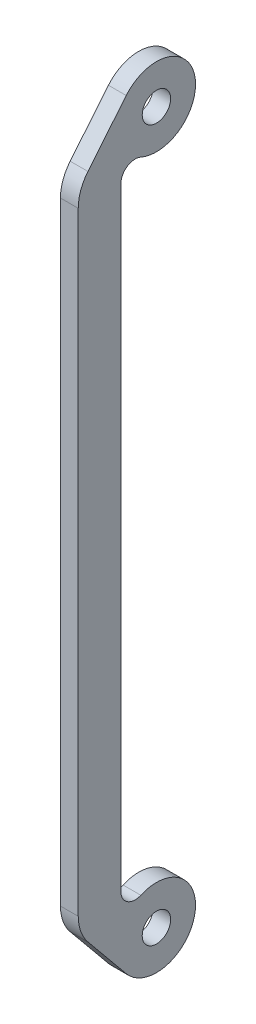
ISO-10303-21;
HEADER;
FILE_DESCRIPTION(('STEP AP214'),'2;1');
FILE_NAME('part.step','',(''),(''),'','','');
FILE_SCHEMA(('AUTOMOTIVE_DESIGN { 1 0 10303 214 1 1 1 1 }'));
ENDSEC;
DATA;
#1=APPLICATION_CONTEXT('core data for automotive mechanical design processes');
#2=APPLICATION_PROTOCOL_DEFINITION('international standard','automotive_design',2000,#1);
#3=PRODUCT_CONTEXT('',#1,'mechanical');
#4=PRODUCT('Part','Part','',(#3));
#5=PRODUCT_RELATED_PRODUCT_CATEGORY('part','',(#4));
#6=PRODUCT_DEFINITION_FORMATION('','',#4);
#7=PRODUCT_DEFINITION_CONTEXT('part definition',#1,'design');
#8=PRODUCT_DEFINITION('design','',#6,#7);
#9=PRODUCT_DEFINITION_SHAPE('','',#8);
#10=(LENGTH_UNIT() NAMED_UNIT(*) SI_UNIT(.MILLI.,.METRE.));
#11=(NAMED_UNIT(*) PLANE_ANGLE_UNIT() SI_UNIT($,.RADIAN.));
#12=(NAMED_UNIT(*) SI_UNIT($,.STERADIAN.) SOLID_ANGLE_UNIT());
#13=UNCERTAINTY_MEASURE_WITH_UNIT(LENGTH_MEASURE(1.E-05),#10,'distance_accuracy_value','');
#14=(GEOMETRIC_REPRESENTATION_CONTEXT(3) GLOBAL_UNCERTAINTY_ASSIGNED_CONTEXT((#13)) GLOBAL_UNIT_ASSIGNED_CONTEXT((#10,
#11,#12)) REPRESENTATION_CONTEXT('',''));
#15=CARTESIAN_POINT('',(0.,0.,0.));
#16=DIRECTION('',(0.,0.,1.));
#17=DIRECTION('',(1.,0.,0.));
#18=AXIS2_PLACEMENT_3D('',#15,#16,#17);
#19=CARTESIAN_POINT('',(97.4999999999046,88.7522729343273,5.99999995622887));
#20=DIRECTION('',(-1.,-1.10653153306827E-12,0.));
#21=DIRECTION('',(0.,-2.58294427513128E-12,1.));
#22=AXIS2_PLACEMENT_3D('',#19,#20,#21);
#23=PLANE('',#22);
#24=CARTESIAN_POINT('',(97.5000000001107,-97.4999999999899,-2.58167619227049E-10));
#25=DIRECTION('',(-1.,-1.10653153306827E-12,0.));
#26=DIRECTION('',(0.,-2.58294427513128E-12,1.));
#27=AXIS2_PLACEMENT_3D('',#24,#25,#26);
#28=CIRCLE('',#27,4.);
#29=CARTESIAN_POINT('',(97.5000000001107,-97.5000000000002,3.99999999974183));
#30=VERTEX_POINT('',#29);
#31=EDGE_CURVE('E162',#30,#30,#28,.T.);
#32=ORIENTED_EDGE('',*,*,#31,.F.);
#33=EDGE_LOOP('',(#32));
#34=FACE_BOUND('',#33,.T.);
#35=CARTESIAN_POINT('',(97.4999999999046,88.7522729343273,5.99999995622887));
#36=DIRECTION('',(1.,1.10653153306827E-12,0.));
#37=DIRECTION('',(0.,-2.58294427513128E-12,1.));
#38=AXIS2_PLACEMENT_3D('',#35,#36,#37);
#39=CIRCLE('',#38,4.00000000000016);
#40=CARTESIAN_POINT('',(97.4999999999006,92.4183334851762,4.39999994450656));
#41=VERTEX_POINT('',#40);
#42=CARTESIAN_POINT('',(97.4999999999046,88.7522729343169,9.99999995622887));
#43=VERTEX_POINT('',#42);
#44=EDGE_CURVE('E186',#41,#43,#39,.T.);
#45=ORIENTED_EDGE('',*,*,#44,.T.);
#46=DIRECTION('',(1.10653153306827E-12,-1.,-2.58294427513128E-12));
#47=VECTOR('',#46,1.);
#48=CARTESIAN_POINT('',(97.5000000000955,-83.7522728959471,9.9999999557833));
#49=LINE('',#48,#47);
#50=CARTESIAN_POINT('',(97.5000000000955,-83.7522728959471,9.99999995578347));
#51=VERTEX_POINT('',#50);
#52=EDGE_CURVE('E110',#43,#51,#49,.T.);
#53=ORIENTED_EDGE('',*,*,#52,.T.);
#54=CARTESIAN_POINT('',(97.5000000000955,-83.7522728959368,5.9999999557833));
#55=DIRECTION('',(1.,1.10653153306827E-12,0.));
#56=DIRECTION('',(0.,-2.58294427513128E-12,1.));
#57=AXIS2_PLACEMENT_3D('',#54,#55,#56);
#58=CIRCLE('',#57,4.00000000000017);
#59=CARTESIAN_POINT('',(97.5000000000995,-87.4183334570177,4.39999996750551));
#60=VERTEX_POINT('',#59);
#61=EDGE_CURVE('E215',#51,#60,#58,.T.);
#62=ORIENTED_EDGE('',*,*,#61,.T.);
#63=CARTESIAN_POINT('',(97.5000000001107,-97.4999999999899,-2.58167619227049E-10));
#64=DIRECTION('',(-1.,-1.10653153306827E-12,0.));
#65=DIRECTION('',(0.,-2.58294427513128E-12,1.));
#66=AXIS2_PLACEMENT_3D('',#63,#64,#65);
#67=CIRCLE('',#66,11.0000000000002);
#68=CARTESIAN_POINT('',(97.5000000001184,-104.482653611021,8.49956166775536));
#69=VERTEX_POINT('',#68);
#70=EDGE_CURVE('E235',#60,#69,#67,.T.);
#71=ORIENTED_EDGE('',*,*,#70,.T.);
#72=DIRECTION('',(-8.55003000266829E-13,0.772687424364855,0.634786691911863));
#73=VECTOR('',#72,1.);
#74=CARTESIAN_POINT('',(97.5000000001184,-104.482653611021,8.49956166775536));
#75=LINE('',#74,#73);
#76=CARTESIAN_POINT('',(97.5000000001039,-91.3697131988906,19.2722490481608));
#77=VERTEX_POINT('',#76);
#78=EDGE_CURVE('E231',#69,#77,#75,.T.);
#79=ORIENTED_EDGE('',*,*,#78,.T.);
#80=CARTESIAN_POINT('',(97.5000000000955,-83.7522728959471,9.9999999557833));
#81=DIRECTION('',(-1.,-1.10653153306827E-12,0.));
#82=DIRECTION('',(0.,-2.58294427513128E-12,1.));
#83=AXIS2_PLACEMENT_3D('',#80,#81,#82);
#84=CIRCLE('',#83,12.0000000000001);
#85=CARTESIAN_POINT('',(97.5000000000955,-83.7522724027184,21.9999999557833));
#86=VERTEX_POINT('',#85);
#87=EDGE_CURVE('E234',#77,#86,#84,.T.);
#88=ORIENTED_EDGE('',*,*,#87,.T.);
#89=DIRECTION('',(-1.10653153306827E-12,1.,2.58294427513128E-12));
#90=VECTOR('',#89,1.);
#91=CARTESIAN_POINT('',(97.5000000000955,-83.7522724027184,21.9999999557833));
#92=LINE('',#91,#90);
#93=CARTESIAN_POINT('',(97.4999999999046,88.7522734275466,21.999999956229));
#94=VERTEX_POINT('',#93);
#95=EDGE_CURVE('E135',#86,#94,#92,.T.);
#96=ORIENTED_EDGE('',*,*,#95,.T.);
#97=CARTESIAN_POINT('',(97.4999999999046,88.7522729343169,9.99999995622887));
#98=DIRECTION('',(-1.,-1.10653153306827E-12,0.));
#99=DIRECTION('',(0.,-2.58294427513128E-12,1.));
#100=AXIS2_PLACEMENT_3D('',#97,#98,#99);
#101=CIRCLE('',#100,12.0000000000001);
#102=CARTESIAN_POINT('',(97.4999999998962,96.3697132876767,19.272249007188));
#103=VERTEX_POINT('',#102);
#104=EDGE_CURVE('E129',#94,#103,#101,.T.);
#105=ORIENTED_EDGE('',*,*,#104,.T.);
#106=DIRECTION('',(-8.55002996443895E-13,0.772687420913254,-0.634786696113288));
#107=VECTOR('',#106,1.);
#108=CARTESIAN_POINT('',(97.4999999998962,96.3697132876767,19.272249007188));
#109=LINE('',#108,#107);
#110=CARTESIAN_POINT('',(97.4999999998817,109.482653657257,8.49956154231629));
#111=VERTEX_POINT('',#110);
#112=EDGE_CURVE('E133',#103,#111,#109,.T.);
#113=ORIENTED_EDGE('',*,*,#112,.T.);
#114=CARTESIAN_POINT('',(97.4999999998894,102.50000000001,-8.77295671663452E-08));
#115=DIRECTION('',(-1.,-1.10653153306827E-12,0.));
#116=DIRECTION('',(0.,-2.58294427513128E-12,1.));
#117=AXIS2_PLACEMENT_3D('',#114,#115,#116);
#118=CIRCLE('',#117,11.0000000000002);
#119=EDGE_CURVE('E61',#111,#41,#118,.T.);
#120=ORIENTED_EDGE('',*,*,#119,.T.);
#121=EDGE_LOOP('',(#45,#53,#62,#71,#79,#88,#96,#105,#113,#120));
#122=FACE_BOUND('',#121,.T.);
#123=CARTESIAN_POINT('',(97.4999999998894,102.50000000001,-8.77295671663452E-08));
#124=DIRECTION('',(-1.,-1.10653153306827E-12,0.));
#125=DIRECTION('',(0.,-2.58294427513128E-12,1.));
#126=AXIS2_PLACEMENT_3D('',#123,#124,#125);
#127=CIRCLE('',#126,4.00000000000002);
#128=CARTESIAN_POINT('',(97.4999999998894,102.5,3.99999991227046));
#129=VERTEX_POINT('',#128);
#130=EDGE_CURVE('E253',#129,#129,#127,.T.);
#131=ORIENTED_EDGE('',*,*,#130,.F.);
#132=EDGE_LOOP('',(#131));
#133=FACE_BOUND('',#132,.T.);
#134=ADVANCED_FACE('F43',(#34,#122,#133),#23,.T.);
#135=CARTESIAN_POINT('',(102.499999999905,88.7522729343328,5.99999995622887));
#136=DIRECTION('',(-1.,-1.10653153306827E-12,0.));
#137=DIRECTION('',(0.,-2.58294427513128E-12,1.));
#138=AXIS2_PLACEMENT_3D('',#135,#136,#137);
#139=PLANE('',#138);
#140=CARTESIAN_POINT('',(102.499999999905,88.7522729343328,5.99999995622887));
#141=DIRECTION('',(1.,1.10653153306827E-12,0.));
#142=DIRECTION('',(0.,-2.58294427513128E-12,1.));
#143=AXIS2_PLACEMENT_3D('',#140,#141,#142);
#144=CIRCLE('',#143,4.00000000000016);
#145=CARTESIAN_POINT('',(102.499999999901,92.4183334851817,4.39999994450656));
#146=VERTEX_POINT('',#145);
#147=CARTESIAN_POINT('',(102.499999999905,88.7522729343224,9.99999995622887));
#148=VERTEX_POINT('',#147);
#149=EDGE_CURVE('E157',#146,#148,#144,.T.);
#150=ORIENTED_EDGE('',*,*,#149,.F.);
#151=CARTESIAN_POINT('',(102.499999999889,102.500000000016,-8.77295671663452E-08));
#152=DIRECTION('',(-1.,-1.10653153306827E-12,0.));
#153=DIRECTION('',(0.,-2.58294427513128E-12,1.));
#154=AXIS2_PLACEMENT_3D('',#151,#152,#153);
#155=CIRCLE('',#154,11.0000000000002);
#156=CARTESIAN_POINT('',(102.499999999882,109.482653657262,8.49956154231629));
#157=VERTEX_POINT('',#156);
#158=EDGE_CURVE('E102',#157,#146,#155,.T.);
#159=ORIENTED_EDGE('',*,*,#158,.F.);
#160=DIRECTION('',(-8.55002996443895E-13,0.772687420913254,-0.634786696113288));
#161=VECTOR('',#160,1.);
#162=CARTESIAN_POINT('',(102.499999999896,96.3697132876822,19.272249007188));
#163=LINE('',#162,#161);
#164=CARTESIAN_POINT('',(102.499999999896,96.3697132876822,19.272249007188));
#165=VERTEX_POINT('',#164);
#166=EDGE_CURVE('E96',#165,#157,#163,.T.);
#167=ORIENTED_EDGE('',*,*,#166,.F.);
#168=CARTESIAN_POINT('',(102.499999999905,88.7522729343224,9.99999995622887));
#169=DIRECTION('',(-1.,-1.10653153306827E-12,0.));
#170=DIRECTION('',(0.,-2.58294427513128E-12,1.));
#171=AXIS2_PLACEMENT_3D('',#168,#169,#170);
#172=CIRCLE('',#171,12.0000000000001);
#173=CARTESIAN_POINT('',(102.499999999905,88.7522734275521,21.999999956229));
#174=VERTEX_POINT('',#173);
#175=EDGE_CURVE('E144',#174,#165,#172,.T.);
#176=ORIENTED_EDGE('',*,*,#175,.F.);
#177=DIRECTION('',(-1.10653153306827E-12,1.,2.58294427513128E-12));
#178=VECTOR('',#177,1.);
#179=CARTESIAN_POINT('',(102.500000000095,-83.7522724027129,21.9999999557833));
#180=LINE('',#179,#178);
#181=CARTESIAN_POINT('',(102.500000000095,-83.7522724027129,21.9999999557833));
#182=VERTEX_POINT('',#181);
#183=EDGE_CURVE('E177',#182,#174,#180,.T.);
#184=ORIENTED_EDGE('',*,*,#183,.F.);
#185=CARTESIAN_POINT('',(102.500000000095,-83.7522728959416,9.9999999557833));
#186=DIRECTION('',(-1.,-1.10653153306827E-12,0.));
#187=DIRECTION('',(0.,-2.58294427513128E-12,1.));
#188=AXIS2_PLACEMENT_3D('',#185,#186,#187);
#189=CIRCLE('',#188,12.0000000000001);
#190=CARTESIAN_POINT('',(102.500000000104,-91.369713198885,19.2722490481608));
#191=VERTEX_POINT('',#190);
#192=EDGE_CURVE('E174',#191,#182,#189,.T.);
#193=ORIENTED_EDGE('',*,*,#192,.F.);
#194=DIRECTION('',(-8.55003000266829E-13,0.772687424364855,0.634786691911863));
#195=VECTOR('',#194,1.);
#196=CARTESIAN_POINT('',(102.500000000118,-104.482653611015,8.49956166775536));
#197=LINE('',#196,#195);
#198=CARTESIAN_POINT('',(102.500000000118,-104.482653611015,8.49956166775536));
#199=VERTEX_POINT('',#198);
#200=EDGE_CURVE('E171',#199,#191,#197,.T.);
#201=ORIENTED_EDGE('',*,*,#200,.F.);
#202=CARTESIAN_POINT('',(102.500000000111,-97.4999999999844,-2.58167619227034E-10));
#203=DIRECTION('',(-1.,-1.10653153306827E-12,0.));
#204=DIRECTION('',(0.,-2.58294427513128E-12,1.));
#205=AXIS2_PLACEMENT_3D('',#202,#203,#204);
#206=CIRCLE('',#205,11.0000000000002);
#207=CARTESIAN_POINT('',(102.5000000001,-87.4183334570122,4.39999996750551));
#208=VERTEX_POINT('',#207);
#209=EDGE_CURVE('E168',#208,#199,#206,.T.);
#210=ORIENTED_EDGE('',*,*,#209,.F.);
#211=CARTESIAN_POINT('',(102.500000000095,-83.7522728959312,5.9999999557833));
#212=DIRECTION('',(1.,1.10653153306827E-12,0.));
#213=DIRECTION('',(0.,-2.58294427513128E-12,1.));
#214=AXIS2_PLACEMENT_3D('',#211,#212,#213);
#215=CIRCLE('',#214,4.00000000000017);
#216=CARTESIAN_POINT('',(102.500000000095,-83.7522728959416,9.99999995578347));
#217=VERTEX_POINT('',#216);
#218=EDGE_CURVE('E165',#217,#208,#215,.T.);
#219=ORIENTED_EDGE('',*,*,#218,.F.);
#220=DIRECTION('',(1.10653153306827E-12,-1.,-2.58294427513128E-12));
#221=VECTOR('',#220,1.);
#222=CARTESIAN_POINT('',(102.500000000095,-83.7522728959416,9.9999999557833));
#223=LINE('',#222,#221);
#224=EDGE_CURVE('E161',#148,#217,#223,.T.);
#225=ORIENTED_EDGE('',*,*,#224,.F.);
#226=EDGE_LOOP('',(#150,#159,#167,#176,#184,#193,#201,#210,#219,#225));
#227=FACE_BOUND('',#226,.T.);
#228=CARTESIAN_POINT('',(102.500000000111,-97.4999999999844,-2.58167619227034E-10));
#229=DIRECTION('',(-1.,-1.10653153306827E-12,0.));
#230=DIRECTION('',(0.,-2.58294427513128E-12,1.));
#231=AXIS2_PLACEMENT_3D('',#228,#229,#230);
#232=CIRCLE('',#231,4.);
#233=CARTESIAN_POINT('',(102.500000000111,-97.4999999999947,3.99999999974183));
#234=VERTEX_POINT('',#233);
#235=EDGE_CURVE('E249',#234,#234,#232,.T.);
#236=ORIENTED_EDGE('',*,*,#235,.T.);
#237=EDGE_LOOP('',(#236));
#238=FACE_BOUND('',#237,.T.);
#239=CARTESIAN_POINT('',(102.499999999889,102.500000000016,-8.77295671663452E-08));
#240=DIRECTION('',(-1.,-1.10653153306827E-12,0.));
#241=DIRECTION('',(0.,-2.58294427513128E-12,1.));
#242=AXIS2_PLACEMENT_3D('',#239,#240,#241);
#243=CIRCLE('',#242,4.00000000000002);
#244=CARTESIAN_POINT('',(102.499999999889,102.500000000005,3.99999991227046));
#245=VERTEX_POINT('',#244);
#246=EDGE_CURVE('E257',#245,#245,#243,.T.);
#247=ORIENTED_EDGE('',*,*,#246,.T.);
#248=EDGE_LOOP('',(#247));
#249=FACE_BOUND('',#248,.T.);
#250=ADVANCED_FACE('F219',(#227,#238,#249),#139,.F.);
#251=CARTESIAN_POINT('',(97.4999999999046,88.7522729343273,5.99999995622887));
#252=DIRECTION('',(1.,1.10653153306827E-12,0.));
#253=DIRECTION('',(0.,2.58294427513128E-12,-1.));
#254=AXIS2_PLACEMENT_3D('',#251,#252,#253);
#255=CYLINDRICAL_SURFACE('',#254,4.00000000000016);
#256=ORIENTED_EDGE('',*,*,#149,.T.);
#257=DIRECTION('',(1.,1.10653153306827E-12,0.));
#258=VECTOR('',#257,1.);
#259=CARTESIAN_POINT('',(97.4999999999046,88.7522729343169,9.99999995622887));
#260=LINE('',#259,#258);
#261=EDGE_CURVE('E11',#43,#148,#260,.T.);
#262=ORIENTED_EDGE('',*,*,#261,.F.);
#263=ORIENTED_EDGE('',*,*,#44,.F.);
#264=DIRECTION('',(1.,1.10653153306827E-12,0.));
#265=VECTOR('',#264,1.);
#266=CARTESIAN_POINT('',(97.4999999999006,92.4183334851762,4.39999994450656));
#267=LINE('',#266,#265);
#268=EDGE_CURVE('E153',#41,#146,#267,.T.);
#269=ORIENTED_EDGE('',*,*,#268,.T.);
#270=EDGE_LOOP('',(#256,#262,#263,#269));
#271=FACE_BOUND('',#270,.T.);
#272=ADVANCED_FACE('F45',(#271),#255,.F.);
#273=CARTESIAN_POINT('',(97.5000000000955,-83.7522728959471,9.9999999557833));
#274=DIRECTION('',(0.,-2.58294427513128E-12,1.));
#275=DIRECTION('',(-1.10653153306827E-12,1.,2.58294427513128E-12));
#276=AXIS2_PLACEMENT_3D('',#273,#274,#275);
#277=PLANE('',#276);
#278=ORIENTED_EDGE('',*,*,#224,.T.);
#279=DIRECTION('',(1.,1.10653153306827E-12,0.));
#280=VECTOR('',#279,1.);
#281=CARTESIAN_POINT('',(97.5000000000955,-83.7522728959471,9.99999995578347));
#282=LINE('',#281,#280);
#283=EDGE_CURVE('E53',#51,#217,#282,.T.);
#284=ORIENTED_EDGE('',*,*,#283,.F.);
#285=ORIENTED_EDGE('',*,*,#52,.F.);
#286=ORIENTED_EDGE('',*,*,#261,.T.);
#287=EDGE_LOOP('',(#278,#284,#285,#286));
#288=FACE_BOUND('',#287,.T.);
#289=ADVANCED_FACE('F299',(#288),#277,.F.);
#290=CARTESIAN_POINT('',(97.5000000000955,-83.7522728959368,5.9999999557833));
#291=DIRECTION('',(1.,1.10653153306827E-12,0.));
#292=DIRECTION('',(0.,2.58294427513128E-12,-1.));
#293=AXIS2_PLACEMENT_3D('',#290,#291,#292);
#294=CYLINDRICAL_SURFACE('',#293,4.00000000000017);
#295=ORIENTED_EDGE('',*,*,#218,.T.);
#296=DIRECTION('',(1.,1.10653153306827E-12,0.));
#297=VECTOR('',#296,1.);
#298=CARTESIAN_POINT('',(97.5000000000995,-87.4183334570177,4.39999996750551));
#299=LINE('',#298,#297);
#300=EDGE_CURVE('E205',#60,#208,#299,.T.);
#301=ORIENTED_EDGE('',*,*,#300,.F.);
#302=ORIENTED_EDGE('',*,*,#61,.F.);
#303=ORIENTED_EDGE('',*,*,#283,.T.);
#304=EDGE_LOOP('',(#295,#301,#302,#303));
#305=FACE_BOUND('',#304,.T.);
#306=ADVANCED_FACE('F213',(#305),#294,.F.);
#307=CARTESIAN_POINT('',(97.5000000001107,-97.4999999999899,-2.58167619227049E-10));
#308=DIRECTION('',(1.,1.10653153306827E-12,0.));
#309=DIRECTION('',(0.,2.58294427513128E-12,-1.));
#310=AXIS2_PLACEMENT_3D('',#307,#308,#309);
#311=CYLINDRICAL_SURFACE('',#310,11.0000000000002);
#312=ORIENTED_EDGE('',*,*,#209,.T.);
#313=DIRECTION('',(1.,1.10653153306827E-12,0.));
#314=VECTOR('',#313,1.);
#315=CARTESIAN_POINT('',(97.5000000001184,-104.482653611021,8.49956166775536));
#316=LINE('',#315,#314);
#317=EDGE_CURVE('E201',#69,#199,#316,.T.);
#318=ORIENTED_EDGE('',*,*,#317,.F.);
#319=ORIENTED_EDGE('',*,*,#70,.F.);
#320=ORIENTED_EDGE('',*,*,#300,.T.);
#321=EDGE_LOOP('',(#312,#318,#319,#320));
#322=FACE_BOUND('',#321,.T.);
#323=ADVANCED_FACE('F225',(#322),#311,.T.);
#324=CARTESIAN_POINT('',(97.5000000001184,-104.482653611021,8.49956166775536));
#325=DIRECTION('',(-7.0241149137036E-13,0.634786691911863,-0.772687424364855));
#326=DIRECTION('',(8.55003000266829E-13,-0.772687424364855,-0.634786691911863));
#327=AXIS2_PLACEMENT_3D('',#324,#325,#326);
#328=PLANE('',#327);
#329=ORIENTED_EDGE('',*,*,#200,.T.);
#330=DIRECTION('',(1.,1.10653153306827E-12,0.));
#331=VECTOR('',#330,1.);
#332=CARTESIAN_POINT('',(97.5000000001039,-91.3697131988906,19.2722490481608));
#333=LINE('',#332,#331);
#334=EDGE_CURVE('E197',#77,#191,#333,.T.);
#335=ORIENTED_EDGE('',*,*,#334,.F.);
#336=ORIENTED_EDGE('',*,*,#78,.F.);
#337=ORIENTED_EDGE('',*,*,#317,.T.);
#338=EDGE_LOOP('',(#329,#335,#336,#337));
#339=FACE_BOUND('',#338,.T.);
#340=ADVANCED_FACE('F229',(#339),#328,.F.);
#341=CARTESIAN_POINT('',(97.5000000000955,-83.7522728959471,9.9999999557833));
#342=DIRECTION('',(1.,1.10653153306827E-12,0.));
#343=DIRECTION('',(0.,2.58294427513128E-12,-1.));
#344=AXIS2_PLACEMENT_3D('',#341,#342,#343);
#345=CYLINDRICAL_SURFACE('',#344,12.0000000000001);
#346=ORIENTED_EDGE('',*,*,#192,.T.);
#347=DIRECTION('',(1.,1.10653153306827E-12,0.));
#348=VECTOR('',#347,1.);
#349=CARTESIAN_POINT('',(97.5000000000955,-83.7522724027184,21.9999999557833));
#350=LINE('',#349,#348);
#351=EDGE_CURVE('E193',#86,#182,#350,.T.);
#352=ORIENTED_EDGE('',*,*,#351,.F.);
#353=ORIENTED_EDGE('',*,*,#87,.F.);
#354=ORIENTED_EDGE('',*,*,#334,.T.);
#355=EDGE_LOOP('',(#346,#352,#353,#354));
#356=FACE_BOUND('',#355,.T.);
#357=ADVANCED_FACE('F289',(#356),#345,.T.);
#358=CARTESIAN_POINT('',(97.5000000000955,-83.7522724027184,21.9999999557833));
#359=DIRECTION('',(0.,2.58294427513128E-12,-1.));
#360=DIRECTION('',(1.10653153306827E-12,-1.,-2.58294427513128E-12));
#361=AXIS2_PLACEMENT_3D('',#358,#359,#360);
#362=PLANE('',#361);
#363=ORIENTED_EDGE('',*,*,#183,.T.);
#364=DIRECTION('',(1.,1.10653153306827E-12,0.));
#365=VECTOR('',#364,1.);
#366=CARTESIAN_POINT('',(97.4999999999046,88.7522734275466,21.999999956229));
#367=LINE('',#366,#365);
#368=EDGE_CURVE('E146',#94,#174,#367,.T.);
#369=ORIENTED_EDGE('',*,*,#368,.F.);
#370=ORIENTED_EDGE('',*,*,#95,.F.);
#371=ORIENTED_EDGE('',*,*,#351,.T.);
#372=EDGE_LOOP('',(#363,#369,#370,#371));
#373=FACE_BOUND('',#372,.T.);
#374=ADVANCED_FACE('F286',(#373),#362,.F.);
#375=CARTESIAN_POINT('',(97.4999999999046,88.7522729343169,9.99999995622887));
#376=DIRECTION('',(1.,1.10653153306827E-12,0.));
#377=DIRECTION('',(0.,2.58294427513128E-12,-1.));
#378=AXIS2_PLACEMENT_3D('',#375,#376,#377);
#379=CYLINDRICAL_SURFACE('',#378,12.0000000000001);
#380=ORIENTED_EDGE('',*,*,#175,.T.);
#381=DIRECTION('',(1.,1.10653153306827E-12,0.));
#382=VECTOR('',#381,1.);
#383=CARTESIAN_POINT('',(97.4999999998962,96.3697132876767,19.272249007188));
#384=LINE('',#383,#382);
#385=EDGE_CURVE('E141',#103,#165,#384,.T.);
#386=ORIENTED_EDGE('',*,*,#385,.F.);
#387=ORIENTED_EDGE('',*,*,#104,.F.);
#388=ORIENTED_EDGE('',*,*,#368,.T.);
#389=EDGE_LOOP('',(#380,#386,#387,#388));
#390=FACE_BOUND('',#389,.T.);
#391=ADVANCED_FACE('F142',(#390),#379,.T.);
#392=CARTESIAN_POINT('',(97.4999999998962,96.3697132876767,19.272249007188));
#393=DIRECTION('',(7.02411496023786E-13,-0.634786696113288,-0.772687420913254));
#394=DIRECTION('',(8.55002996443895E-13,-0.772687420913254,0.634786696113288));
#395=AXIS2_PLACEMENT_3D('',#392,#393,#394);
#396=PLANE('',#395);
#397=ORIENTED_EDGE('',*,*,#166,.T.);
#398=DIRECTION('',(1.,1.10653153306827E-12,0.));
#399=VECTOR('',#398,1.);
#400=CARTESIAN_POINT('',(97.4999999998817,109.482653657257,8.49956154231629));
#401=LINE('',#400,#399);
#402=EDGE_CURVE('E147',#111,#157,#401,.T.);
#403=ORIENTED_EDGE('',*,*,#402,.F.);
#404=ORIENTED_EDGE('',*,*,#112,.F.);
#405=ORIENTED_EDGE('',*,*,#385,.T.);
#406=EDGE_LOOP('',(#397,#403,#404,#405));
#407=FACE_BOUND('',#406,.T.);
#408=ADVANCED_FACE('F149',(#407),#396,.F.);
#409=CARTESIAN_POINT('',(97.4999999998894,102.50000000001,-8.77295671663452E-08));
#410=DIRECTION('',(1.,1.10653153306827E-12,0.));
#411=DIRECTION('',(0.,2.58294427513128E-12,-1.));
#412=AXIS2_PLACEMENT_3D('',#409,#410,#411);
#413=CYLINDRICAL_SURFACE('',#412,11.0000000000002);
#414=ORIENTED_EDGE('',*,*,#158,.T.);
#415=ORIENTED_EDGE('',*,*,#268,.F.);
#416=ORIENTED_EDGE('',*,*,#119,.F.);
#417=ORIENTED_EDGE('',*,*,#402,.T.);
#418=EDGE_LOOP('',(#414,#415,#416,#417));
#419=FACE_BOUND('',#418,.T.);
#420=ADVANCED_FACE('F279',(#419),#413,.T.);
#421=CARTESIAN_POINT('',(97.5000000001107,-97.4999999999899,-2.58167619227049E-10));
#422=DIRECTION('',(1.,1.10653153306827E-12,0.));
#423=DIRECTION('',(0.,2.58294427513128E-12,-1.));
#424=AXIS2_PLACEMENT_3D('',#421,#422,#423);
#425=CYLINDRICAL_SURFACE('',#424,4.);
#426=ORIENTED_EDGE('',*,*,#31,.T.);
#427=EDGE_LOOP('',(#426));
#428=FACE_BOUND('',#427,.T.);
#429=ORIENTED_EDGE('',*,*,#235,.F.);
#430=EDGE_LOOP('',(#429));
#431=FACE_BOUND('',#430,.T.);
#432=ADVANCED_FACE('F276',(#428,#431),#425,.F.);
#433=CARTESIAN_POINT('',(97.4999999998894,102.50000000001,-8.77295671663452E-08));
#434=DIRECTION('',(1.,1.10653153306827E-12,0.));
#435=DIRECTION('',(0.,2.58294427513128E-12,-1.));
#436=AXIS2_PLACEMENT_3D('',#433,#434,#435);
#437=CYLINDRICAL_SURFACE('',#436,4.00000000000002);
#438=ORIENTED_EDGE('',*,*,#130,.T.);
#439=EDGE_LOOP('',(#438));
#440=FACE_BOUND('',#439,.T.);
#441=ORIENTED_EDGE('',*,*,#246,.F.);
#442=EDGE_LOOP('',(#441));
#443=FACE_BOUND('',#442,.T.);
#444=ADVANCED_FACE('F265',(#440,#443),#437,.F.);
#445=CLOSED_SHELL('',(#134,#250,#272,#289,#306,#323,#340,#357,#374,#391,#408,#420,#432,#444));
#446=MANIFOLD_SOLID_BREP('B2',#445);
#447=ADVANCED_BREP_SHAPE_REPRESENTATION('',(#18,#446),#14);
#448=SHAPE_DEFINITION_REPRESENTATION(#9,#447);
ENDSEC;
END-ISO-10303-21;
